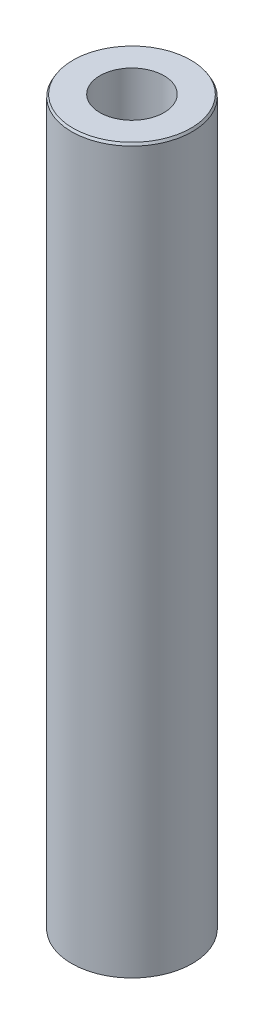
ISO-10303-21;
HEADER;
FILE_DESCRIPTION(('STEP AP214'),'2;1');
FILE_NAME('part.step','',(''),(''),'','','');
FILE_SCHEMA(('AUTOMOTIVE_DESIGN { 1 0 10303 214 1 1 1 1 }'));
ENDSEC;
DATA;
#1=APPLICATION_CONTEXT('core data for automotive mechanical design processes');
#2=APPLICATION_PROTOCOL_DEFINITION('international standard','automotive_design',2000,#1);
#3=PRODUCT_CONTEXT('',#1,'mechanical');
#4=PRODUCT('Part','Part','',(#3));
#5=PRODUCT_RELATED_PRODUCT_CATEGORY('part','',(#4));
#6=PRODUCT_DEFINITION_FORMATION('','',#4);
#7=PRODUCT_DEFINITION_CONTEXT('part definition',#1,'design');
#8=PRODUCT_DEFINITION('design','',#6,#7);
#9=PRODUCT_DEFINITION_SHAPE('','',#8);
#10=(LENGTH_UNIT() NAMED_UNIT(*) SI_UNIT(.MILLI.,.METRE.));
#11=(NAMED_UNIT(*) PLANE_ANGLE_UNIT() SI_UNIT($,.RADIAN.));
#12=(NAMED_UNIT(*) SI_UNIT($,.STERADIAN.) SOLID_ANGLE_UNIT());
#13=UNCERTAINTY_MEASURE_WITH_UNIT(LENGTH_MEASURE(1.E-05),#10,'distance_accuracy_value','');
#14=(GEOMETRIC_REPRESENTATION_CONTEXT(3) GLOBAL_UNCERTAINTY_ASSIGNED_CONTEXT((#13)) GLOBAL_UNIT_ASSIGNED_CONTEXT((#10,
#11,#12)) REPRESENTATION_CONTEXT('',''));
#15=CARTESIAN_POINT('',(0.,0.,0.));
#16=DIRECTION('',(0.,0.,1.));
#17=DIRECTION('',(1.,0.,0.));
#18=AXIS2_PLACEMENT_3D('',#15,#16,#17);
#19=CARTESIAN_POINT('',(0.,600.,0.));
#20=DIRECTION('',(0.,-1.,0.));
#21=DIRECTION('',(0.,0.,-1.));
#22=AXIS2_PLACEMENT_3D('',#19,#20,#21);
#23=CYLINDRICAL_SURFACE('',#22,50.);
#24=CARTESIAN_POINT('',(0.,598.030049009945,0.));
#25=DIRECTION('',(0.,1.,0.));
#26=DIRECTION('',(0.,0.,1.));
#27=AXIS2_PLACEMENT_3D('',#24,#25,#26);
#28=CIRCLE('',#27,50.);
#29=CARTESIAN_POINT('',(0.,598.030049009945,50.));
#30=VERTEX_POINT('',#29);
#31=EDGE_CURVE('E50',#30,#30,#28,.F.);
#32=ORIENTED_EDGE('',*,*,#31,.T.);
#33=EDGE_LOOP('',(#32));
#34=FACE_BOUND('',#33,.T.);
#35=CARTESIAN_POINT('',(0.,1.13735173439855,0.));
#36=DIRECTION('',(0.,1.,0.));
#37=DIRECTION('',(0.,0.,1.));
#38=AXIS2_PLACEMENT_3D('',#35,#36,#37);
#39=CIRCLE('',#38,50.);
#40=CARTESIAN_POINT('',(0.,1.13735173439855,50.));
#41=VERTEX_POINT('',#40);
#42=EDGE_CURVE('E51',#41,#41,#39,.T.);
#43=ORIENTED_EDGE('',*,*,#42,.T.);
#44=EDGE_LOOP('',(#43));
#45=FACE_BOUND('',#44,.T.);
#46=ADVANCED_FACE('F39',(#34,#45),#23,.T.);
#47=CARTESIAN_POINT('',(0.,600.,0.));
#48=DIRECTION('',(0.,1.,0.));
#49=DIRECTION('',(0.,0.,1.));
#50=AXIS2_PLACEMENT_3D('',#47,#48,#49);
#51=PLANE('',#50);
#52=CARTESIAN_POINT('',(0.,600.,0.));
#53=DIRECTION('',(0.,1.,0.));
#54=DIRECTION('',(0.,0.,1.));
#55=AXIS2_PLACEMENT_3D('',#52,#53,#54);
#56=CIRCLE('',#55,48.8626482656013);
#57=CARTESIAN_POINT('',(0.,600.,48.8626482656013));
#58=VERTEX_POINT('',#57);
#59=EDGE_CURVE('E54',#58,#58,#56,.T.);
#60=ORIENTED_EDGE('',*,*,#59,.T.);
#61=EDGE_LOOP('',(#60));
#62=FACE_BOUND('',#61,.T.);
#63=CARTESIAN_POINT('',(0.,600.,0.));
#64=DIRECTION('',(0.,1.,0.));
#65=DIRECTION('',(0.,0.,1.));
#66=AXIS2_PLACEMENT_3D('',#63,#64,#65);
#67=CIRCLE('',#66,26.5466006860223);
#68=CARTESIAN_POINT('',(0.,600.,26.5466006860223));
#69=VERTEX_POINT('',#68);
#70=EDGE_CURVE('E58',#69,#69,#67,.T.);
#71=ORIENTED_EDGE('',*,*,#70,.F.);
#72=EDGE_LOOP('',(#71));
#73=FACE_BOUND('',#72,.T.);
#74=ADVANCED_FACE('F69',(#62,#73),#51,.T.);
#75=CARTESIAN_POINT('',(0.,0.,0.));
#76=DIRECTION('',(0.,1.,0.));
#77=DIRECTION('',(0.,0.,1.));
#78=AXIS2_PLACEMENT_3D('',#75,#76,#77);
#79=PLANE('',#78);
#80=CARTESIAN_POINT('',(0.,0.,0.));
#81=DIRECTION('',(0.,1.,0.));
#82=DIRECTION('',(0.,0.,1.));
#83=AXIS2_PLACEMENT_3D('',#80,#81,#82);
#84=CIRCLE('',#83,48.030049009945);
#85=CARTESIAN_POINT('',(0.,0.,48.030049009945));
#86=VERTEX_POINT('',#85);
#87=EDGE_CURVE('E10',#86,#86,#84,.F.);
#88=ORIENTED_EDGE('',*,*,#87,.T.);
#89=EDGE_LOOP('',(#88));
#90=FACE_BOUND('',#89,.T.);
#91=CARTESIAN_POINT('',(0.,0.,0.));
#92=DIRECTION('',(0.,1.,0.));
#93=DIRECTION('',(0.,0.,1.));
#94=AXIS2_PLACEMENT_3D('',#91,#92,#93);
#95=CIRCLE('',#94,26.5466006860223);
#96=CARTESIAN_POINT('',(0.,0.,26.5466006860223));
#97=VERTEX_POINT('',#96);
#98=EDGE_CURVE('E63',#97,#97,#95,.T.);
#99=ORIENTED_EDGE('',*,*,#98,.T.);
#100=EDGE_LOOP('',(#99));
#101=FACE_BOUND('',#100,.T.);
#102=ADVANCED_FACE('F75',(#90,#101),#79,.F.);
#103=CARTESIAN_POINT('',(0.,600.,0.));
#104=DIRECTION('',(0.,-1.,0.));
#105=DIRECTION('',(0.,0.,-1.));
#106=AXIS2_PLACEMENT_3D('',#103,#104,#105);
#107=CYLINDRICAL_SURFACE('',#106,26.5466006860223);
#108=ORIENTED_EDGE('',*,*,#70,.T.);
#109=EDGE_LOOP('',(#108));
#110=FACE_BOUND('',#109,.T.);
#111=ORIENTED_EDGE('',*,*,#98,.F.);
#112=EDGE_LOOP('',(#111));
#113=FACE_BOUND('',#112,.T.);
#114=ADVANCED_FACE('F70',(#110,#113),#107,.F.);
#115=CARTESIAN_POINT('',(0.,600.,0.));
#116=DIRECTION('',(0.,-1.,0.));
#117=DIRECTION('',(0.,0.,-1.));
#118=AXIS2_PLACEMENT_3D('',#115,#116,#117);
#119=CONICAL_SURFACE('',#118,48.8626482656013,0.523598775598283);
#120=ORIENTED_EDGE('',*,*,#31,.F.);
#121=EDGE_LOOP('',(#120));
#122=FACE_BOUND('',#121,.T.);
#123=ORIENTED_EDGE('',*,*,#59,.F.);
#124=EDGE_LOOP('',(#123));
#125=FACE_BOUND('',#124,.T.);
#126=ADVANCED_FACE('F81',(#122,#125),#119,.T.);
#127=CARTESIAN_POINT('',(0.,1.13735173439855,0.));
#128=DIRECTION('',(0.,1.,0.));
#129=DIRECTION('',(0.,0.,1.));
#130=AXIS2_PLACEMENT_3D('',#127,#128,#129);
#131=CONICAL_SURFACE('',#130,50.,1.04719755119662);
#132=ORIENTED_EDGE('',*,*,#87,.F.);
#133=EDGE_LOOP('',(#132));
#134=FACE_BOUND('',#133,.T.);
#135=ORIENTED_EDGE('',*,*,#42,.F.);
#136=EDGE_LOOP('',(#135));
#137=FACE_BOUND('',#136,.T.);
#138=ADVANCED_FACE('F45',(#134,#137),#131,.T.);
#139=CLOSED_SHELL('',(#46,#74,#102,#114,#126,#138));
#140=MANIFOLD_SOLID_BREP('B2',#139);
#141=ADVANCED_BREP_SHAPE_REPRESENTATION('',(#18,#140),#14);
#142=SHAPE_DEFINITION_REPRESENTATION(#9,#141);
ENDSEC;
END-ISO-10303-21;
